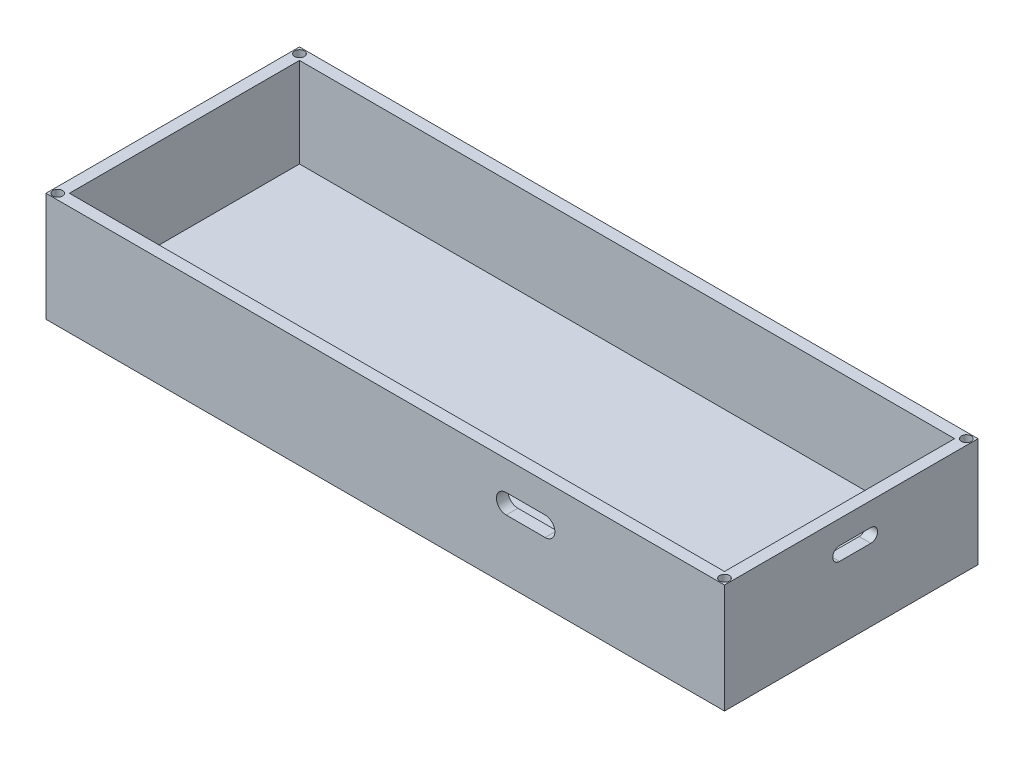
ISO-10303-21;
HEADER;
FILE_DESCRIPTION(('STEP AP214'),'2;1');
FILE_NAME('part.step','',(''),(''),'','','');
FILE_SCHEMA(('AUTOMOTIVE_DESIGN { 1 0 10303 214 1 1 1 1 }'));
ENDSEC;
DATA;
#1=APPLICATION_CONTEXT('core data for automotive mechanical design processes');
#2=APPLICATION_PROTOCOL_DEFINITION('international standard','automotive_design',2000,#1);
#3=PRODUCT_CONTEXT('',#1,'mechanical');
#4=PRODUCT('Part','Part','',(#3));
#5=PRODUCT_RELATED_PRODUCT_CATEGORY('part','',(#4));
#6=PRODUCT_DEFINITION_FORMATION('','',#4);
#7=PRODUCT_DEFINITION_CONTEXT('part definition',#1,'design');
#8=PRODUCT_DEFINITION('design','',#6,#7);
#9=PRODUCT_DEFINITION_SHAPE('','',#8);
#10=(LENGTH_UNIT() NAMED_UNIT(*) SI_UNIT(.MILLI.,.METRE.));
#11=(NAMED_UNIT(*) PLANE_ANGLE_UNIT() SI_UNIT($,.RADIAN.));
#12=(NAMED_UNIT(*) SI_UNIT($,.STERADIAN.) SOLID_ANGLE_UNIT());
#13=UNCERTAINTY_MEASURE_WITH_UNIT(LENGTH_MEASURE(1.E-05),#10,'distance_accuracy_value','');
#14=(GEOMETRIC_REPRESENTATION_CONTEXT(3) GLOBAL_UNCERTAINTY_ASSIGNED_CONTEXT((#13)) GLOBAL_UNIT_ASSIGNED_CONTEXT((#10,
#11,#12)) REPRESENTATION_CONTEXT('',''));
#15=CARTESIAN_POINT('',(0.,0.,0.));
#16=DIRECTION('',(0.,0.,1.));
#17=DIRECTION('',(1.,0.,0.));
#18=AXIS2_PLACEMENT_3D('',#15,#16,#17);
#19=CARTESIAN_POINT('',(0.,5.,0.));
#20=DIRECTION('',(1.,0.,0.));
#21=DIRECTION('',(0.,0.,-1.));
#22=AXIS2_PLACEMENT_3D('',#19,#20,#21);
#23=PLANE('',#22);
#24=DIRECTION('',(0.,0.,1.));
#25=VECTOR('',#24,1.);
#26=CARTESIAN_POINT('',(0.,0.,0.));
#27=LINE('',#26,#25);
#28=CARTESIAN_POINT('',(0.,0.,-65.));
#29=VERTEX_POINT('',#28);
#30=CARTESIAN_POINT('',(0.,0.,0.));
#31=VERTEX_POINT('',#30);
#32=EDGE_CURVE('E308',#29,#31,#27,.T.);
#33=ORIENTED_EDGE('',*,*,#32,.T.);
#34=DIRECTION('',(0.,-1.,0.));
#35=VECTOR('',#34,1.);
#36=CARTESIAN_POINT('',(0.,5.,0.));
#37=LINE('',#36,#35);
#38=CARTESIAN_POINT('',(0.,28.,0.));
#39=VERTEX_POINT('',#38);
#40=EDGE_CURVE('E333',#39,#31,#37,.T.);
#41=ORIENTED_EDGE('',*,*,#40,.F.);
#42=DIRECTION('',(0.,0.,1.));
#43=VECTOR('',#42,1.);
#44=CARTESIAN_POINT('',(0.,28.,-65.));
#45=LINE('',#44,#43);
#46=CARTESIAN_POINT('',(0.,28.,-65.));
#47=VERTEX_POINT('',#46);
#48=EDGE_CURVE('E292',#47,#39,#45,.T.);
#49=ORIENTED_EDGE('',*,*,#48,.F.);
#50=DIRECTION('',(0.,-1.,0.));
#51=VECTOR('',#50,1.);
#52=CARTESIAN_POINT('',(0.,5.,-65.));
#53=LINE('',#52,#51);
#54=EDGE_CURVE('E321',#47,#29,#53,.T.);
#55=ORIENTED_EDGE('',*,*,#54,.T.);
#56=EDGE_LOOP('',(#33,#41,#49,#55));
#57=FACE_BOUND('',#56,.T.);
#58=ADVANCED_FACE('F43',(#57),#23,.F.);
#59=CARTESIAN_POINT('',(0.,5.,0.));
#60=DIRECTION('',(0.,0.,-1.));
#61=DIRECTION('',(-1.,0.,0.));
#62=AXIS2_PLACEMENT_3D('',#59,#60,#61);
#63=PLANE('',#62);
#64=DIRECTION('',(-1.,0.,0.));
#65=VECTOR('',#64,1.);
#66=CARTESIAN_POINT('',(128.,20.55,0.));
#67=LINE('',#66,#65);
#68=CARTESIAN_POINT('',(128.,20.55,0.));
#69=VERTEX_POINT('',#68);
#70=CARTESIAN_POINT('',(118.,20.55,0.));
#71=VERTEX_POINT('',#70);
#72=EDGE_CURVE('E168',#69,#71,#67,.T.);
#73=ORIENTED_EDGE('',*,*,#72,.F.);
#74=CARTESIAN_POINT('',(128.,18.05,0.));
#75=DIRECTION('',(0.,0.,1.));
#76=DIRECTION('',(1.,0.,0.));
#77=AXIS2_PLACEMENT_3D('',#74,#75,#76);
#78=CIRCLE('',#77,2.5);
#79=CARTESIAN_POINT('',(128.,15.55,0.));
#80=VERTEX_POINT('',#79);
#81=EDGE_CURVE('E58',#80,#69,#78,.T.);
#82=ORIENTED_EDGE('',*,*,#81,.F.);
#83=DIRECTION('',(1.,0.,0.));
#84=VECTOR('',#83,1.);
#85=CARTESIAN_POINT('',(128.,15.55,0.));
#86=LINE('',#85,#84);
#87=CARTESIAN_POINT('',(118.,15.55,0.));
#88=VERTEX_POINT('',#87);
#89=EDGE_CURVE('E176',#88,#80,#86,.T.);
#90=ORIENTED_EDGE('',*,*,#89,.F.);
#91=CARTESIAN_POINT('',(118.,18.05,0.));
#92=DIRECTION('',(0.,0.,1.));
#93=DIRECTION('',(1.,0.,0.));
#94=AXIS2_PLACEMENT_3D('',#91,#92,#93);
#95=CIRCLE('',#94,2.5);
#96=EDGE_CURVE('E158',#71,#88,#95,.T.);
#97=ORIENTED_EDGE('',*,*,#96,.F.);
#98=EDGE_LOOP('',(#73,#82,#90,#97));
#99=FACE_BOUND('',#98,.T.);
#100=DIRECTION('',(1.,0.,0.));
#101=VECTOR('',#100,1.);
#102=CARTESIAN_POINT('',(0.,0.,0.));
#103=LINE('',#102,#101);
#104=CARTESIAN_POINT('',(174.,0.,0.));
#105=VERTEX_POINT('',#104);
#106=EDGE_CURVE('E312',#31,#105,#103,.T.);
#107=ORIENTED_EDGE('',*,*,#106,.T.);
#108=DIRECTION('',(0.,-1.,0.));
#109=VECTOR('',#108,1.);
#110=CARTESIAN_POINT('',(174.,5.,0.));
#111=LINE('',#110,#109);
#112=CARTESIAN_POINT('',(174.,28.,0.));
#113=VERTEX_POINT('',#112);
#114=EDGE_CURVE('E329',#113,#105,#111,.T.);
#115=ORIENTED_EDGE('',*,*,#114,.F.);
#116=DIRECTION('',(1.,0.,0.));
#117=VECTOR('',#116,1.);
#118=CARTESIAN_POINT('',(0.,28.,0.));
#119=LINE('',#118,#117);
#120=EDGE_CURVE('E296',#39,#113,#119,.T.);
#121=ORIENTED_EDGE('',*,*,#120,.F.);
#122=ORIENTED_EDGE('',*,*,#40,.T.);
#123=EDGE_LOOP('',(#107,#115,#121,#122));
#124=FACE_BOUND('',#123,.T.);
#125=ADVANCED_FACE('F173',(#99,#124),#63,.F.);
#126=CARTESIAN_POINT('',(174.,5.,0.));
#127=DIRECTION('',(-1.,0.,0.));
#128=DIRECTION('',(0.,0.,1.));
#129=AXIS2_PLACEMENT_3D('',#126,#127,#128);
#130=PLANE('',#129);
#131=DIRECTION('',(0.,0.,-1.));
#132=VECTOR('',#131,1.);
#133=CARTESIAN_POINT('',(174.,18.5,-29.5));
#134=LINE('',#133,#132);
#135=CARTESIAN_POINT('',(174.,18.5,-29.5));
#136=VERTEX_POINT('',#135);
#137=CARTESIAN_POINT('',(174.,18.5,-37.5));
#138=VERTEX_POINT('',#137);
#139=EDGE_CURVE('E225',#136,#138,#134,.T.);
#140=ORIENTED_EDGE('',*,*,#139,.F.);
#141=CARTESIAN_POINT('',(174.,20.25,-29.5));
#142=DIRECTION('',(1.,0.,0.));
#143=DIRECTION('',(0.,0.,-1.));
#144=AXIS2_PLACEMENT_3D('',#141,#142,#143);
#145=CIRCLE('',#144,1.74999999999999);
#146=CARTESIAN_POINT('',(174.,22.,-29.5));
#147=VERTEX_POINT('',#146);
#148=EDGE_CURVE('E219',#147,#136,#145,.T.);
#149=ORIENTED_EDGE('',*,*,#148,.F.);
#150=DIRECTION('',(0.,0.,1.));
#151=VECTOR('',#150,1.);
#152=CARTESIAN_POINT('',(174.,22.,-29.5));
#153=LINE('',#152,#151);
#154=CARTESIAN_POINT('',(174.,22.,-37.5));
#155=VERTEX_POINT('',#154);
#156=EDGE_CURVE('E233',#155,#147,#153,.T.);
#157=ORIENTED_EDGE('',*,*,#156,.F.);
#158=CARTESIAN_POINT('',(174.,20.25,-37.5));
#159=DIRECTION('',(1.,0.,0.));
#160=DIRECTION('',(0.,0.,-1.));
#161=AXIS2_PLACEMENT_3D('',#158,#159,#160);
#162=CIRCLE('',#161,1.74999999999999);
#163=EDGE_CURVE('E229',#138,#155,#162,.T.);
#164=ORIENTED_EDGE('',*,*,#163,.F.);
#165=EDGE_LOOP('',(#140,#149,#157,#164));
#166=FACE_BOUND('',#165,.T.);
#167=DIRECTION('',(0.,0.,-1.));
#168=VECTOR('',#167,1.);
#169=CARTESIAN_POINT('',(174.,0.,0.));
#170=LINE('',#169,#168);
#171=CARTESIAN_POINT('',(174.,0.,-65.));
#172=VERTEX_POINT('',#171);
#173=EDGE_CURVE('E315',#105,#172,#170,.T.);
#174=ORIENTED_EDGE('',*,*,#173,.T.);
#175=DIRECTION('',(0.,-1.,0.));
#176=VECTOR('',#175,1.);
#177=CARTESIAN_POINT('',(174.,5.,-65.));
#178=LINE('',#177,#176);
#179=CARTESIAN_POINT('',(174.,28.,-65.));
#180=VERTEX_POINT('',#179);
#181=EDGE_CURVE('E325',#180,#172,#178,.T.);
#182=ORIENTED_EDGE('',*,*,#181,.F.);
#183=DIRECTION('',(0.,0.,-1.));
#184=VECTOR('',#183,1.);
#185=CARTESIAN_POINT('',(174.,28.,-65.));
#186=LINE('',#185,#184);
#187=EDGE_CURVE('E300',#113,#180,#186,.T.);
#188=ORIENTED_EDGE('',*,*,#187,.F.);
#189=ORIENTED_EDGE('',*,*,#114,.T.);
#190=EDGE_LOOP('',(#174,#182,#188,#189));
#191=FACE_BOUND('',#190,.T.);
#192=ADVANCED_FACE('F382',(#166,#191),#130,.F.);
#193=CARTESIAN_POINT('',(0.,5.,-65.));
#194=DIRECTION('',(0.,0.,1.));
#195=DIRECTION('',(1.,0.,0.));
#196=AXIS2_PLACEMENT_3D('',#193,#194,#195);
#197=PLANE('',#196);
#198=DIRECTION('',(-1.,0.,0.));
#199=VECTOR('',#198,1.);
#200=CARTESIAN_POINT('',(0.,0.,-65.));
#201=LINE('',#200,#199);
#202=EDGE_CURVE('E318',#172,#29,#201,.T.);
#203=ORIENTED_EDGE('',*,*,#202,.T.);
#204=ORIENTED_EDGE('',*,*,#54,.F.);
#205=DIRECTION('',(-1.,0.,0.));
#206=VECTOR('',#205,1.);
#207=CARTESIAN_POINT('',(0.,28.,-65.));
#208=LINE('',#207,#206);
#209=EDGE_CURVE('E304',#180,#47,#208,.T.);
#210=ORIENTED_EDGE('',*,*,#209,.F.);
#211=ORIENTED_EDGE('',*,*,#181,.T.);
#212=EDGE_LOOP('',(#203,#204,#210,#211));
#213=FACE_BOUND('',#212,.T.);
#214=ADVANCED_FACE('F396',(#213),#197,.F.);
#215=CARTESIAN_POINT('',(0.,0.,0.));
#216=DIRECTION('',(0.,-1.,0.));
#217=DIRECTION('',(0.,0.,-1.));
#218=AXIS2_PLACEMENT_3D('',#215,#216,#217);
#219=PLANE('',#218);
#220=ORIENTED_EDGE('',*,*,#32,.F.);
#221=ORIENTED_EDGE('',*,*,#202,.F.);
#222=ORIENTED_EDGE('',*,*,#173,.F.);
#223=ORIENTED_EDGE('',*,*,#106,.F.);
#224=EDGE_LOOP('',(#220,#221,#222,#223));
#225=FACE_BOUND('',#224,.T.);
#226=ADVANCED_FACE('F388',(#225),#219,.T.);
#227=CARTESIAN_POINT('',(0.,28.,0.));
#228=DIRECTION('',(0.,1.,0.));
#229=DIRECTION('',(0.,0.,1.));
#230=AXIS2_PLACEMENT_3D('',#227,#228,#229);
#231=PLANE('',#230);
#232=CARTESIAN_POINT('',(172.5,28.,-63.5));
#233=DIRECTION('',(0.,1.,0.));
#234=DIRECTION('',(0.,0.,1.));
#235=AXIS2_PLACEMENT_3D('',#232,#233,#234);
#236=CIRCLE('',#235,1.25);
#237=CARTESIAN_POINT('',(172.5,28.,-62.25));
#238=VERTEX_POINT('',#237);
#239=EDGE_CURVE('E186',#238,#238,#236,.T.);
#240=ORIENTED_EDGE('',*,*,#239,.F.);
#241=EDGE_LOOP('',(#240));
#242=FACE_BOUND('',#241,.T.);
#243=CARTESIAN_POINT('',(172.5,28.,-1.5));
#244=DIRECTION('',(0.,1.,0.));
#245=DIRECTION('',(0.,0.,1.));
#246=AXIS2_PLACEMENT_3D('',#243,#244,#245);
#247=CIRCLE('',#246,1.25);
#248=CARTESIAN_POINT('',(172.5,28.,-0.25));
#249=VERTEX_POINT('',#248);
#250=EDGE_CURVE('E198',#249,#249,#247,.T.);
#251=ORIENTED_EDGE('',*,*,#250,.F.);
#252=EDGE_LOOP('',(#251));
#253=FACE_BOUND('',#252,.T.);
#254=CARTESIAN_POINT('',(1.5,28.,-63.5));
#255=DIRECTION('',(0.,1.,0.));
#256=DIRECTION('',(0.,0.,1.));
#257=AXIS2_PLACEMENT_3D('',#254,#255,#256);
#258=CIRCLE('',#257,1.25);
#259=CARTESIAN_POINT('',(1.5,28.,-62.25));
#260=VERTEX_POINT('',#259);
#261=EDGE_CURVE('E206',#260,#260,#258,.T.);
#262=ORIENTED_EDGE('',*,*,#261,.F.);
#263=EDGE_LOOP('',(#262));
#264=FACE_BOUND('',#263,.T.);
#265=CARTESIAN_POINT('',(1.5,28.,-1.5));
#266=DIRECTION('',(0.,1.,0.));
#267=DIRECTION('',(0.,0.,1.));
#268=AXIS2_PLACEMENT_3D('',#265,#266,#267);
#269=CIRCLE('',#268,1.25);
#270=CARTESIAN_POINT('',(1.5,28.,-0.25));
#271=VERTEX_POINT('',#270);
#272=EDGE_CURVE('E214',#271,#271,#269,.T.);
#273=ORIENTED_EDGE('',*,*,#272,.F.);
#274=EDGE_LOOP('',(#273));
#275=FACE_BOUND('',#274,.T.);
#276=ORIENTED_EDGE('',*,*,#48,.T.);
#277=ORIENTED_EDGE('',*,*,#120,.T.);
#278=ORIENTED_EDGE('',*,*,#187,.T.);
#279=ORIENTED_EDGE('',*,*,#209,.T.);
#280=EDGE_LOOP('',(#276,#277,#278,#279));
#281=FACE_BOUND('',#280,.T.);
#282=DIRECTION('',(0.,0.,1.));
#283=VECTOR('',#282,1.);
#284=CARTESIAN_POINT('',(3.,28.,-62.));
#285=LINE('',#284,#283);
#286=CARTESIAN_POINT('',(3.,28.,-62.));
#287=VERTEX_POINT('',#286);
#288=CARTESIAN_POINT('',(3.,28.,-3.));
#289=VERTEX_POINT('',#288);
#290=EDGE_CURVE('E254',#287,#289,#285,.T.);
#291=ORIENTED_EDGE('',*,*,#290,.F.);
#292=DIRECTION('',(-1.,0.,0.));
#293=VECTOR('',#292,1.);
#294=CARTESIAN_POINT('',(3.,28.,-62.));
#295=LINE('',#294,#293);
#296=CARTESIAN_POINT('',(171.,28.,-62.));
#297=VERTEX_POINT('',#296);
#298=EDGE_CURVE('E251',#297,#287,#295,.T.);
#299=ORIENTED_EDGE('',*,*,#298,.F.);
#300=DIRECTION('',(0.,0.,-1.));
#301=VECTOR('',#300,1.);
#302=CARTESIAN_POINT('',(171.,28.,-62.));
#303=LINE('',#302,#301);
#304=CARTESIAN_POINT('',(171.,28.,-3.));
#305=VERTEX_POINT('',#304);
#306=EDGE_CURVE('E262',#305,#297,#303,.T.);
#307=ORIENTED_EDGE('',*,*,#306,.F.);
#308=DIRECTION('',(1.,0.,0.));
#309=VECTOR('',#308,1.);
#310=CARTESIAN_POINT('',(3.,28.,-3.));
#311=LINE('',#310,#309);
#312=EDGE_CURVE('E258',#289,#305,#311,.T.);
#313=ORIENTED_EDGE('',*,*,#312,.F.);
#314=EDGE_LOOP('',(#291,#299,#307,#313));
#315=FACE_BOUND('',#314,.T.);
#316=ADVANCED_FACE('F392',(#242,#253,#264,#275,#281,#315),#231,.T.);
#317=CARTESIAN_POINT('',(3.,28.,-62.));
#318=DIRECTION('',(0.,0.,1.));
#319=DIRECTION('',(1.,0.,0.));
#320=AXIS2_PLACEMENT_3D('',#317,#318,#319);
#321=PLANE('',#320);
#322=DIRECTION('',(-1.,0.,0.));
#323=VECTOR('',#322,1.);
#324=CARTESIAN_POINT('',(3.,5.,-62.));
#325=LINE('',#324,#323);
#326=CARTESIAN_POINT('',(171.,5.,-62.));
#327=VERTEX_POINT('',#326);
#328=CARTESIAN_POINT('',(3.,5.,-62.));
#329=VERTEX_POINT('',#328);
#330=EDGE_CURVE('E241',#327,#329,#325,.T.);
#331=ORIENTED_EDGE('',*,*,#330,.F.);
#332=DIRECTION('',(0.,-1.,0.));
#333=VECTOR('',#332,1.);
#334=CARTESIAN_POINT('',(171.,28.,-62.));
#335=LINE('',#334,#333);
#336=EDGE_CURVE('E265',#297,#327,#335,.T.);
#337=ORIENTED_EDGE('',*,*,#336,.F.);
#338=ORIENTED_EDGE('',*,*,#298,.T.);
#339=DIRECTION('',(0.,-1.,0.));
#340=VECTOR('',#339,1.);
#341=CARTESIAN_POINT('',(3.,28.,-62.));
#342=LINE('',#341,#340);
#343=EDGE_CURVE('E288',#287,#329,#342,.T.);
#344=ORIENTED_EDGE('',*,*,#343,.T.);
#345=EDGE_LOOP('',(#331,#337,#338,#344));
#346=FACE_BOUND('',#345,.T.);
#347=ADVANCED_FACE('F417',(#346),#321,.T.);
#348=CARTESIAN_POINT('',(3.,28.,-62.));
#349=DIRECTION('',(1.,0.,0.));
#350=DIRECTION('',(0.,0.,-1.));
#351=AXIS2_PLACEMENT_3D('',#348,#349,#350);
#352=PLANE('',#351);
#353=DIRECTION('',(0.,0.,1.));
#354=VECTOR('',#353,1.);
#355=CARTESIAN_POINT('',(3.,5.,-62.));
#356=LINE('',#355,#354);
#357=CARTESIAN_POINT('',(3.,5.,-3.));
#358=VERTEX_POINT('',#357);
#359=EDGE_CURVE('E269',#329,#358,#356,.T.);
#360=ORIENTED_EDGE('',*,*,#359,.F.);
#361=ORIENTED_EDGE('',*,*,#343,.F.);
#362=ORIENTED_EDGE('',*,*,#290,.T.);
#363=DIRECTION('',(0.,-1.,0.));
#364=VECTOR('',#363,1.);
#365=CARTESIAN_POINT('',(3.,28.,-3.));
#366=LINE('',#365,#364);
#367=EDGE_CURVE('E285',#289,#358,#366,.T.);
#368=ORIENTED_EDGE('',*,*,#367,.T.);
#369=EDGE_LOOP('',(#360,#361,#362,#368));
#370=FACE_BOUND('',#369,.T.);
#371=ADVANCED_FACE('F421',(#370),#352,.T.);
#372=CARTESIAN_POINT('',(3.,28.,-3.));
#373=DIRECTION('',(0.,0.,-1.));
#374=DIRECTION('',(-1.,0.,0.));
#375=AXIS2_PLACEMENT_3D('',#372,#373,#374);
#376=PLANE('',#375);
#377=CARTESIAN_POINT('',(128.,18.05,-3.));
#378=DIRECTION('',(0.,0.,-1.));
#379=DIRECTION('',(-1.,0.,0.));
#380=AXIS2_PLACEMENT_3D('',#377,#378,#379);
#381=CIRCLE('',#380,2.5);
#382=CARTESIAN_POINT('',(128.,20.55,-3.));
#383=VERTEX_POINT('',#382);
#384=CARTESIAN_POINT('',(128.,15.55,-3.));
#385=VERTEX_POINT('',#384);
#386=EDGE_CURVE('E11',#383,#385,#381,.T.);
#387=ORIENTED_EDGE('',*,*,#386,.F.);
#388=DIRECTION('',(1.,0.,0.));
#389=VECTOR('',#388,1.);
#390=CARTESIAN_POINT('',(3.,20.55,-3.));
#391=LINE('',#390,#389);
#392=CARTESIAN_POINT('',(118.,20.55,-3.));
#393=VERTEX_POINT('',#392);
#394=EDGE_CURVE('E350',#393,#383,#391,.T.);
#395=ORIENTED_EDGE('',*,*,#394,.F.);
#396=CARTESIAN_POINT('',(118.,18.05,-3.));
#397=DIRECTION('',(0.,0.,-1.));
#398=DIRECTION('',(-1.,0.,0.));
#399=AXIS2_PLACEMENT_3D('',#396,#397,#398);
#400=CIRCLE('',#399,2.5);
#401=CARTESIAN_POINT('',(118.,15.55,-3.));
#402=VERTEX_POINT('',#401);
#403=EDGE_CURVE('E161',#402,#393,#400,.T.);
#404=ORIENTED_EDGE('',*,*,#403,.F.);
#405=DIRECTION('',(-1.,0.,0.));
#406=VECTOR('',#405,1.);
#407=CARTESIAN_POINT('',(3.,15.55,-3.));
#408=LINE('',#407,#406);
#409=EDGE_CURVE('E51',#385,#402,#408,.T.);
#410=ORIENTED_EDGE('',*,*,#409,.F.);
#411=EDGE_LOOP('',(#387,#395,#404,#410));
#412=FACE_BOUND('',#411,.T.);
#413=DIRECTION('',(1.,0.,0.));
#414=VECTOR('',#413,1.);
#415=CARTESIAN_POINT('',(3.,5.,-3.));
#416=LINE('',#415,#414);
#417=CARTESIAN_POINT('',(171.,5.,-3.));
#418=VERTEX_POINT('',#417);
#419=EDGE_CURVE('E273',#358,#418,#416,.T.);
#420=ORIENTED_EDGE('',*,*,#419,.F.);
#421=ORIENTED_EDGE('',*,*,#367,.F.);
#422=ORIENTED_EDGE('',*,*,#312,.T.);
#423=DIRECTION('',(0.,-1.,0.));
#424=VECTOR('',#423,1.);
#425=CARTESIAN_POINT('',(171.,28.,-3.));
#426=LINE('',#425,#424);
#427=EDGE_CURVE('E282',#305,#418,#426,.T.);
#428=ORIENTED_EDGE('',*,*,#427,.T.);
#429=EDGE_LOOP('',(#420,#421,#422,#428));
#430=FACE_BOUND('',#429,.T.);
#431=ADVANCED_FACE('F361',(#412,#430),#376,.T.);
#432=CARTESIAN_POINT('',(171.,28.,-62.));
#433=DIRECTION('',(-1.,0.,0.));
#434=DIRECTION('',(0.,0.,1.));
#435=AXIS2_PLACEMENT_3D('',#432,#433,#434);
#436=PLANE('',#435);
#437=CARTESIAN_POINT('',(171.,20.25,-29.5));
#438=DIRECTION('',(-1.,0.,0.));
#439=DIRECTION('',(0.,0.,1.));
#440=AXIS2_PLACEMENT_3D('',#437,#438,#439);
#441=CIRCLE('',#440,1.74999999999999);
#442=CARTESIAN_POINT('',(171.,18.5,-29.5));
#443=VERTEX_POINT('',#442);
#444=CARTESIAN_POINT('',(171.,22.,-29.5));
#445=VERTEX_POINT('',#444);
#446=EDGE_CURVE('E347',#443,#445,#441,.T.);
#447=ORIENTED_EDGE('',*,*,#446,.F.);
#448=DIRECTION('',(0.,0.,1.));
#449=VECTOR('',#448,1.);
#450=CARTESIAN_POINT('',(171.,18.5,-62.));
#451=LINE('',#450,#449);
#452=CARTESIAN_POINT('',(171.,18.5,-37.5));
#453=VERTEX_POINT('',#452);
#454=EDGE_CURVE('E337',#453,#443,#451,.T.);
#455=ORIENTED_EDGE('',*,*,#454,.F.);
#456=CARTESIAN_POINT('',(171.,20.25,-37.5));
#457=DIRECTION('',(-1.,0.,0.));
#458=DIRECTION('',(0.,0.,1.));
#459=AXIS2_PLACEMENT_3D('',#456,#457,#458);
#460=CIRCLE('',#459,1.74999999999999);
#461=CARTESIAN_POINT('',(171.,22.,-37.5));
#462=VERTEX_POINT('',#461);
#463=EDGE_CURVE('E340',#462,#453,#460,.T.);
#464=ORIENTED_EDGE('',*,*,#463,.F.);
#465=DIRECTION('',(0.,0.,-1.));
#466=VECTOR('',#465,1.);
#467=CARTESIAN_POINT('',(171.,22.,-62.));
#468=LINE('',#467,#466);
#469=EDGE_CURVE('E344',#445,#462,#468,.T.);
#470=ORIENTED_EDGE('',*,*,#469,.F.);
#471=EDGE_LOOP('',(#447,#455,#464,#470));
#472=FACE_BOUND('',#471,.T.);
#473=DIRECTION('',(0.,0.,-1.));
#474=VECTOR('',#473,1.);
#475=CARTESIAN_POINT('',(171.,5.,-62.));
#476=LINE('',#475,#474);
#477=EDGE_CURVE('E255',#418,#327,#476,.T.);
#478=ORIENTED_EDGE('',*,*,#477,.F.);
#479=ORIENTED_EDGE('',*,*,#427,.F.);
#480=ORIENTED_EDGE('',*,*,#306,.T.);
#481=ORIENTED_EDGE('',*,*,#336,.T.);
#482=EDGE_LOOP('',(#478,#479,#480,#481));
#483=FACE_BOUND('',#482,.T.);
#484=ADVANCED_FACE('F413',(#472,#483),#436,.T.);
#485=CARTESIAN_POINT('',(0.,5.,0.));
#486=DIRECTION('',(0.,-1.,0.));
#487=DIRECTION('',(0.,0.,-1.));
#488=AXIS2_PLACEMENT_3D('',#485,#486,#487);
#489=PLANE('',#488);
#490=ORIENTED_EDGE('',*,*,#477,.T.);
#491=ORIENTED_EDGE('',*,*,#330,.T.);
#492=ORIENTED_EDGE('',*,*,#359,.T.);
#493=ORIENTED_EDGE('',*,*,#419,.T.);
#494=EDGE_LOOP('',(#490,#491,#492,#493));
#495=FACE_BOUND('',#494,.T.);
#496=ADVANCED_FACE('F409',(#495),#489,.F.);
#497=CARTESIAN_POINT('',(151.,20.25,-29.5));
#498=DIRECTION('',(1.,0.,0.));
#499=DIRECTION('',(0.,0.,-1.));
#500=AXIS2_PLACEMENT_3D('',#497,#498,#499);
#501=CYLINDRICAL_SURFACE('',#500,1.74999999999999);
#502=ORIENTED_EDGE('',*,*,#446,.T.);
#503=DIRECTION('',(1.,0.,0.));
#504=VECTOR('',#503,1.);
#505=CARTESIAN_POINT('',(151.,22.,-29.5));
#506=LINE('',#505,#504);
#507=EDGE_CURVE('E238',#445,#147,#506,.T.);
#508=ORIENTED_EDGE('',*,*,#507,.T.);
#509=ORIENTED_EDGE('',*,*,#148,.T.);
#510=DIRECTION('',(1.,0.,0.));
#511=VECTOR('',#510,1.);
#512=CARTESIAN_POINT('',(151.,18.5,-29.5));
#513=LINE('',#512,#511);
#514=EDGE_CURVE('E237',#443,#136,#513,.T.);
#515=ORIENTED_EDGE('',*,*,#514,.F.);
#516=EDGE_LOOP('',(#502,#508,#509,#515));
#517=FACE_BOUND('',#516,.T.);
#518=ADVANCED_FACE('F412',(#517),#501,.F.);
#519=CARTESIAN_POINT('',(151.,22.,-29.5));
#520=DIRECTION('',(0.,1.,0.));
#521=DIRECTION('',(0.,0.,1.));
#522=AXIS2_PLACEMENT_3D('',#519,#520,#521);
#523=PLANE('',#522);
#524=ORIENTED_EDGE('',*,*,#469,.T.);
#525=DIRECTION('',(1.,0.,0.));
#526=VECTOR('',#525,1.);
#527=CARTESIAN_POINT('',(151.,22.,-37.5));
#528=LINE('',#527,#526);
#529=EDGE_CURVE('E242',#462,#155,#528,.T.);
#530=ORIENTED_EDGE('',*,*,#529,.T.);
#531=ORIENTED_EDGE('',*,*,#156,.T.);
#532=ORIENTED_EDGE('',*,*,#507,.F.);
#533=EDGE_LOOP('',(#524,#530,#531,#532));
#534=FACE_BOUND('',#533,.T.);
#535=ADVANCED_FACE('F433',(#534),#523,.F.);
#536=CARTESIAN_POINT('',(151.,20.25,-37.5));
#537=DIRECTION('',(1.,0.,0.));
#538=DIRECTION('',(0.,0.,-1.));
#539=AXIS2_PLACEMENT_3D('',#536,#537,#538);
#540=CYLINDRICAL_SURFACE('',#539,1.74999999999999);
#541=ORIENTED_EDGE('',*,*,#463,.T.);
#542=DIRECTION('',(1.,0.,0.));
#543=VECTOR('',#542,1.);
#544=CARTESIAN_POINT('',(151.,18.5,-37.5));
#545=LINE('',#544,#543);
#546=EDGE_CURVE('E245',#453,#138,#545,.T.);
#547=ORIENTED_EDGE('',*,*,#546,.T.);
#548=ORIENTED_EDGE('',*,*,#163,.T.);
#549=ORIENTED_EDGE('',*,*,#529,.F.);
#550=EDGE_LOOP('',(#541,#547,#548,#549));
#551=FACE_BOUND('',#550,.T.);
#552=ADVANCED_FACE('F439',(#551),#540,.F.);
#553=CARTESIAN_POINT('',(151.,18.5,-29.5));
#554=DIRECTION('',(0.,-1.,0.));
#555=DIRECTION('',(0.,0.,-1.));
#556=AXIS2_PLACEMENT_3D('',#553,#554,#555);
#557=PLANE('',#556);
#558=ORIENTED_EDGE('',*,*,#454,.T.);
#559=ORIENTED_EDGE('',*,*,#514,.T.);
#560=ORIENTED_EDGE('',*,*,#139,.T.);
#561=ORIENTED_EDGE('',*,*,#546,.F.);
#562=EDGE_LOOP('',(#558,#559,#560,#561));
#563=FACE_BOUND('',#562,.T.);
#564=ADVANCED_FACE('F435',(#563),#557,.F.);
#565=CARTESIAN_POINT('',(1.5,24.,-1.5));
#566=DIRECTION('',(0.,1.,0.));
#567=DIRECTION('',(0.,0.,1.));
#568=AXIS2_PLACEMENT_3D('',#565,#566,#567);
#569=CYLINDRICAL_SURFACE('',#568,1.25);
#570=CARTESIAN_POINT('',(1.5,24.,-1.5));
#571=DIRECTION('',(0.,1.,0.));
#572=DIRECTION('',(0.,0.,1.));
#573=AXIS2_PLACEMENT_3D('',#570,#571,#572);
#574=CIRCLE('',#573,1.25);
#575=CARTESIAN_POINT('',(1.5,24.,-0.25));
#576=VERTEX_POINT('',#575);
#577=EDGE_CURVE('E215',#576,#576,#574,.T.);
#578=ORIENTED_EDGE('',*,*,#577,.F.);
#579=EDGE_LOOP('',(#578));
#580=FACE_BOUND('',#579,.T.);
#581=ORIENTED_EDGE('',*,*,#272,.T.);
#582=EDGE_LOOP('',(#581));
#583=FACE_BOUND('',#582,.T.);
#584=ADVANCED_FACE('F438',(#580,#583),#569,.F.);
#585=CARTESIAN_POINT('',(1.5,24.,-1.5));
#586=DIRECTION('',(0.,1.,0.));
#587=DIRECTION('',(0.,0.,1.));
#588=AXIS2_PLACEMENT_3D('',#585,#586,#587);
#589=PLANE('',#588);
#590=ORIENTED_EDGE('',*,*,#577,.T.);
#591=EDGE_LOOP('',(#590));
#592=FACE_BOUND('',#591,.T.);
#593=ADVANCED_FACE('F449',(#592),#589,.T.);
#594=CARTESIAN_POINT('',(1.5,24.,-63.5));
#595=DIRECTION('',(0.,1.,0.));
#596=DIRECTION('',(0.,0.,1.));
#597=AXIS2_PLACEMENT_3D('',#594,#595,#596);
#598=CYLINDRICAL_SURFACE('',#597,1.25);
#599=CARTESIAN_POINT('',(1.5,24.,-63.5));
#600=DIRECTION('',(0.,1.,0.));
#601=DIRECTION('',(0.,0.,1.));
#602=AXIS2_PLACEMENT_3D('',#599,#600,#601);
#603=CIRCLE('',#602,1.25);
#604=CARTESIAN_POINT('',(1.5,24.,-62.25));
#605=VERTEX_POINT('',#604);
#606=EDGE_CURVE('E210',#605,#605,#603,.T.);
#607=ORIENTED_EDGE('',*,*,#606,.F.);
#608=EDGE_LOOP('',(#607));
#609=FACE_BOUND('',#608,.T.);
#610=ORIENTED_EDGE('',*,*,#261,.T.);
#611=EDGE_LOOP('',(#610));
#612=FACE_BOUND('',#611,.T.);
#613=ADVANCED_FACE('F453',(#609,#612),#598,.F.);
#614=CARTESIAN_POINT('',(1.5,24.,-63.5));
#615=DIRECTION('',(0.,1.,0.));
#616=DIRECTION('',(0.,0.,1.));
#617=AXIS2_PLACEMENT_3D('',#614,#615,#616);
#618=PLANE('',#617);
#619=ORIENTED_EDGE('',*,*,#606,.T.);
#620=EDGE_LOOP('',(#619));
#621=FACE_BOUND('',#620,.T.);
#622=ADVANCED_FACE('F457',(#621),#618,.T.);
#623=CARTESIAN_POINT('',(172.5,24.,-1.5));
#624=DIRECTION('',(0.,1.,0.));
#625=DIRECTION('',(0.,0.,1.));
#626=AXIS2_PLACEMENT_3D('',#623,#624,#625);
#627=CYLINDRICAL_SURFACE('',#626,1.25);
#628=CARTESIAN_POINT('',(172.5,24.,-1.5));
#629=DIRECTION('',(0.,1.,0.));
#630=DIRECTION('',(0.,0.,1.));
#631=AXIS2_PLACEMENT_3D('',#628,#629,#630);
#632=CIRCLE('',#631,1.25);
#633=CARTESIAN_POINT('',(172.5,24.,-0.25));
#634=VERTEX_POINT('',#633);
#635=EDGE_CURVE('E202',#634,#634,#632,.T.);
#636=ORIENTED_EDGE('',*,*,#635,.F.);
#637=EDGE_LOOP('',(#636));
#638=FACE_BOUND('',#637,.T.);
#639=ORIENTED_EDGE('',*,*,#250,.T.);
#640=EDGE_LOOP('',(#639));
#641=FACE_BOUND('',#640,.T.);
#642=ADVANCED_FACE('F461',(#638,#641),#627,.F.);
#643=CARTESIAN_POINT('',(172.5,24.,-1.5));
#644=DIRECTION('',(0.,1.,0.));
#645=DIRECTION('',(0.,0.,1.));
#646=AXIS2_PLACEMENT_3D('',#643,#644,#645);
#647=PLANE('',#646);
#648=ORIENTED_EDGE('',*,*,#635,.T.);
#649=EDGE_LOOP('',(#648));
#650=FACE_BOUND('',#649,.T.);
#651=ADVANCED_FACE('F465',(#650),#647,.T.);
#652=CARTESIAN_POINT('',(172.5,24.,-63.5));
#653=DIRECTION('',(0.,1.,0.));
#654=DIRECTION('',(0.,0.,1.));
#655=AXIS2_PLACEMENT_3D('',#652,#653,#654);
#656=CYLINDRICAL_SURFACE('',#655,1.25);
#657=CARTESIAN_POINT('',(172.5,24.,-63.5));
#658=DIRECTION('',(0.,1.,0.));
#659=DIRECTION('',(0.,0.,1.));
#660=AXIS2_PLACEMENT_3D('',#657,#658,#659);
#661=CIRCLE('',#660,1.25);
#662=CARTESIAN_POINT('',(172.5,24.,-62.25));
#663=VERTEX_POINT('',#662);
#664=EDGE_CURVE('E194',#663,#663,#661,.T.);
#665=ORIENTED_EDGE('',*,*,#664,.F.);
#666=EDGE_LOOP('',(#665));
#667=FACE_BOUND('',#666,.T.);
#668=ORIENTED_EDGE('',*,*,#239,.T.);
#669=EDGE_LOOP('',(#668));
#670=FACE_BOUND('',#669,.T.);
#671=ADVANCED_FACE('F373',(#667,#670),#656,.F.);
#672=CARTESIAN_POINT('',(172.5,24.,-63.5));
#673=DIRECTION('',(0.,1.,0.));
#674=DIRECTION('',(0.,0.,1.));
#675=AXIS2_PLACEMENT_3D('',#672,#673,#674);
#676=PLANE('',#675);
#677=ORIENTED_EDGE('',*,*,#664,.T.);
#678=EDGE_LOOP('',(#677));
#679=FACE_BOUND('',#678,.T.);
#680=ADVANCED_FACE('F366',(#679),#676,.T.);
#681=CARTESIAN_POINT('',(128.,18.05,-10.));
#682=DIRECTION('',(0.,0.,1.));
#683=DIRECTION('',(1.,0.,0.));
#684=AXIS2_PLACEMENT_3D('',#681,#682,#683);
#685=CYLINDRICAL_SURFACE('',#684,2.5);
#686=ORIENTED_EDGE('',*,*,#386,.T.);
#687=DIRECTION('',(0.,0.,1.));
#688=VECTOR('',#687,1.);
#689=CARTESIAN_POINT('',(128.,15.55,-10.));
#690=LINE('',#689,#688);
#691=EDGE_CURVE('E183',#385,#80,#690,.T.);
#692=ORIENTED_EDGE('',*,*,#691,.T.);
#693=ORIENTED_EDGE('',*,*,#81,.T.);
#694=DIRECTION('',(0.,0.,1.));
#695=VECTOR('',#694,1.);
#696=CARTESIAN_POINT('',(128.,20.55,-10.));
#697=LINE('',#696,#695);
#698=EDGE_CURVE('E165',#383,#69,#697,.T.);
#699=ORIENTED_EDGE('',*,*,#698,.F.);
#700=EDGE_LOOP('',(#686,#692,#693,#699));
#701=FACE_BOUND('',#700,.T.);
#702=ADVANCED_FACE('F363',(#701),#685,.F.);
#703=CARTESIAN_POINT('',(128.,15.55,-10.));
#704=DIRECTION('',(0.,-1.,0.));
#705=DIRECTION('',(1.,0.,0.));
#706=AXIS2_PLACEMENT_3D('',#703,#704,#705);
#707=PLANE('',#706);
#708=ORIENTED_EDGE('',*,*,#409,.T.);
#709=DIRECTION('',(0.,0.,1.));
#710=VECTOR('',#709,1.);
#711=CARTESIAN_POINT('',(118.,15.55,-10.));
#712=LINE('',#711,#710);
#713=EDGE_CURVE('E164',#402,#88,#712,.T.);
#714=ORIENTED_EDGE('',*,*,#713,.T.);
#715=ORIENTED_EDGE('',*,*,#89,.T.);
#716=ORIENTED_EDGE('',*,*,#691,.F.);
#717=EDGE_LOOP('',(#708,#714,#715,#716));
#718=FACE_BOUND('',#717,.T.);
#719=ADVANCED_FACE('F358',(#718),#707,.F.);
#720=CARTESIAN_POINT('',(118.,18.05,-10.));
#721=DIRECTION('',(0.,0.,1.));
#722=DIRECTION('',(1.,0.,0.));
#723=AXIS2_PLACEMENT_3D('',#720,#721,#722);
#724=CYLINDRICAL_SURFACE('',#723,2.5);
#725=ORIENTED_EDGE('',*,*,#403,.T.);
#726=DIRECTION('',(0.,0.,1.));
#727=VECTOR('',#726,1.);
#728=CARTESIAN_POINT('',(118.,20.55,-10.));
#729=LINE('',#728,#727);
#730=EDGE_CURVE('E66',#393,#71,#729,.T.);
#731=ORIENTED_EDGE('',*,*,#730,.T.);
#732=ORIENTED_EDGE('',*,*,#96,.T.);
#733=ORIENTED_EDGE('',*,*,#713,.F.);
#734=EDGE_LOOP('',(#725,#731,#732,#733));
#735=FACE_BOUND('',#734,.T.);
#736=ADVANCED_FACE('F155',(#735),#724,.F.);
#737=CARTESIAN_POINT('',(128.,20.55,-10.));
#738=DIRECTION('',(0.,1.,0.));
#739=DIRECTION('',(-1.,0.,0.));
#740=AXIS2_PLACEMENT_3D('',#737,#738,#739);
#741=PLANE('',#740);
#742=ORIENTED_EDGE('',*,*,#394,.T.);
#743=ORIENTED_EDGE('',*,*,#698,.T.);
#744=ORIENTED_EDGE('',*,*,#72,.T.);
#745=ORIENTED_EDGE('',*,*,#730,.F.);
#746=EDGE_LOOP('',(#742,#743,#744,#745));
#747=FACE_BOUND('',#746,.T.);
#748=ADVANCED_FACE('F169',(#747),#741,.F.);
#749=CLOSED_SHELL('',(#58,#125,#192,#214,#226,#316,#347,#371,#431,#484,#496,#518,#535,#552,#564,
#584,#593,#613,#622,#642,#651,#671,#680,#702,#719,#736,#748));
#750=MANIFOLD_SOLID_BREP('B2',#749);
#751=ADVANCED_BREP_SHAPE_REPRESENTATION('',(#18,#750),#14);
#752=SHAPE_DEFINITION_REPRESENTATION(#9,#751);
ENDSEC;
END-ISO-10303-21;
